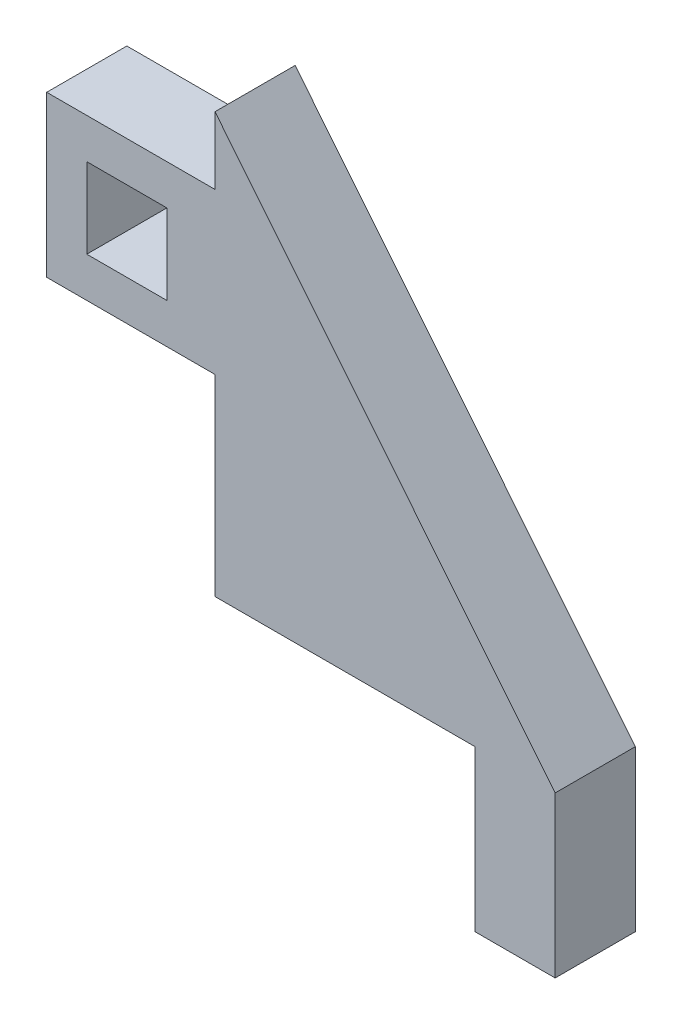
ISO-10303-21;
HEADER;
FILE_DESCRIPTION(('STEP AP214'),'2;1');
FILE_NAME('part.step','',(''),(''),'','','');
FILE_SCHEMA(('AUTOMOTIVE_DESIGN { 1 0 10303 214 1 1 1 1 }'));
ENDSEC;
DATA;
#1=APPLICATION_CONTEXT('core data for automotive mechanical design processes');
#2=APPLICATION_PROTOCOL_DEFINITION('international standard','automotive_design',2000,#1);
#3=PRODUCT_CONTEXT('',#1,'mechanical');
#4=PRODUCT('Part','Part','',(#3));
#5=PRODUCT_RELATED_PRODUCT_CATEGORY('part','',(#4));
#6=PRODUCT_DEFINITION_FORMATION('','',#4);
#7=PRODUCT_DEFINITION_CONTEXT('part definition',#1,'design');
#8=PRODUCT_DEFINITION('design','',#6,#7);
#9=PRODUCT_DEFINITION_SHAPE('','',#8);
#10=(LENGTH_UNIT() NAMED_UNIT(*) SI_UNIT(.MILLI.,.METRE.));
#11=(NAMED_UNIT(*) PLANE_ANGLE_UNIT() SI_UNIT($,.RADIAN.));
#12=(NAMED_UNIT(*) SI_UNIT($,.STERADIAN.) SOLID_ANGLE_UNIT());
#13=UNCERTAINTY_MEASURE_WITH_UNIT(LENGTH_MEASURE(1.E-05),#10,'distance_accuracy_value','');
#14=(GEOMETRIC_REPRESENTATION_CONTEXT(3) GLOBAL_UNCERTAINTY_ASSIGNED_CONTEXT((#13)) GLOBAL_UNIT_ASSIGNED_CONTEXT((#10,
#11,#12)) REPRESENTATION_CONTEXT('',''));
#15=CARTESIAN_POINT('',(0.,0.,0.));
#16=DIRECTION('',(0.,0.,1.));
#17=DIRECTION('',(1.,0.,0.));
#18=AXIS2_PLACEMENT_3D('',#15,#16,#17);
#19=CARTESIAN_POINT('',(0.,0.,5.));
#20=DIRECTION('',(1.,0.,0.));
#21=DIRECTION('',(0.,0.,-1.));
#22=AXIS2_PLACEMENT_3D('',#19,#20,#21);
#23=PLANE('',#22);
#24=DIRECTION('',(0.,0.,-1.));
#25=VECTOR('',#24,1.);
#26=CARTESIAN_POINT('',(0.,22.,0.));
#27=LINE('',#26,#25);
#28=CARTESIAN_POINT('',(0.,22.,5.));
#29=VERTEX_POINT('',#28);
#30=CARTESIAN_POINT('',(0.,22.,0.));
#31=VERTEX_POINT('',#30);
#32=EDGE_CURVE('E178',#29,#31,#27,.T.);
#33=ORIENTED_EDGE('',*,*,#32,.F.);
#34=DIRECTION('',(0.,-1.,0.));
#35=VECTOR('',#34,1.);
#36=CARTESIAN_POINT('',(0.,0.,5.));
#37=LINE('',#36,#35);
#38=CARTESIAN_POINT('',(0.,26.2,5.));
#39=VERTEX_POINT('',#38);
#40=EDGE_CURVE('E225',#39,#29,#37,.T.);
#41=ORIENTED_EDGE('',*,*,#40,.F.);
#42=DIRECTION('',(0.,0.,-1.));
#43=VECTOR('',#42,1.);
#44=CARTESIAN_POINT('',(0.,26.2,5.));
#45=LINE('',#44,#43);
#46=CARTESIAN_POINT('',(0.,26.2,0.));
#47=VERTEX_POINT('',#46);
#48=EDGE_CURVE('E42',#39,#47,#45,.T.);
#49=ORIENTED_EDGE('',*,*,#48,.T.);
#50=DIRECTION('',(0.,-1.,0.));
#51=VECTOR('',#50,1.);
#52=CARTESIAN_POINT('',(0.,0.,0.));
#53=LINE('',#52,#51);
#54=EDGE_CURVE('E253',#47,#31,#53,.T.);
#55=ORIENTED_EDGE('',*,*,#54,.T.);
#56=EDGE_LOOP('',(#33,#41,#49,#55));
#57=FACE_BOUND('',#56,.T.);
#58=ADVANCED_FACE('F33',(#57),#23,.F.);
#59=DIRECTION('',(0.,0.,1.));
#60=VECTOR('',#59,1.);
#61=CARTESIAN_POINT('',(0.,12.,0.));
#62=LINE('',#61,#60);
#63=CARTESIAN_POINT('',(0.,12.,0.));
#64=VERTEX_POINT('',#63);
#65=CARTESIAN_POINT('',(0.,12.,5.));
#66=VERTEX_POINT('',#65);
#67=EDGE_CURVE('E173',#64,#66,#62,.T.);
#68=ORIENTED_EDGE('',*,*,#67,.F.);
#69=CARTESIAN_POINT('',(0.,0.,0.));
#70=VERTEX_POINT('',#69);
#71=EDGE_CURVE('E235',#64,#70,#53,.T.);
#72=ORIENTED_EDGE('',*,*,#71,.T.);
#73=DIRECTION('',(0.,0.,-1.));
#74=VECTOR('',#73,1.);
#75=CARTESIAN_POINT('',(0.,0.,5.));
#76=LINE('',#75,#74);
#77=CARTESIAN_POINT('',(0.,0.,5.));
#78=VERTEX_POINT('',#77);
#79=EDGE_CURVE('E231',#78,#70,#76,.T.);
#80=ORIENTED_EDGE('',*,*,#79,.F.);
#81=EDGE_CURVE('E193',#66,#78,#37,.T.);
#82=ORIENTED_EDGE('',*,*,#81,.F.);
#83=EDGE_LOOP('',(#68,#72,#80,#82));
#84=FACE_BOUND('',#83,.T.);
#85=ADVANCED_FACE('F307',(#84),#23,.F.);
#86=CARTESIAN_POINT('',(21.2263986582746,0.,5.));
#87=DIRECTION('',(0.,1.,0.));
#88=DIRECTION('',(0.,0.,1.));
#89=AXIS2_PLACEMENT_3D('',#86,#87,#88);
#90=PLANE('',#89);
#91=DIRECTION('',(0.,0.,-1.));
#92=VECTOR('',#91,1.);
#93=CARTESIAN_POINT('',(16.2263986582746,0.,5.));
#94=LINE('',#93,#92);
#95=CARTESIAN_POINT('',(16.2263986582746,0.,5.));
#96=VERTEX_POINT('',#95);
#97=CARTESIAN_POINT('',(16.2263986582746,0.,0.));
#98=VERTEX_POINT('',#97);
#99=EDGE_CURVE('E205',#96,#98,#94,.T.);
#100=ORIENTED_EDGE('',*,*,#99,.F.);
#101=DIRECTION('',(1.,0.,0.));
#102=VECTOR('',#101,1.);
#103=CARTESIAN_POINT('',(21.2263986582746,0.,5.));
#104=LINE('',#103,#102);
#105=EDGE_CURVE('E251',#78,#96,#104,.T.);
#106=ORIENTED_EDGE('',*,*,#105,.F.);
#107=ORIENTED_EDGE('',*,*,#79,.T.);
#108=DIRECTION('',(1.,0.,0.));
#109=VECTOR('',#108,1.);
#110=CARTESIAN_POINT('',(21.2263986582746,0.,0.));
#111=LINE('',#110,#109);
#112=EDGE_CURVE('E247',#70,#98,#111,.T.);
#113=ORIENTED_EDGE('',*,*,#112,.T.);
#114=EDGE_LOOP('',(#100,#106,#107,#113));
#115=FACE_BOUND('',#114,.T.);
#116=ADVANCED_FACE('F35',(#115),#90,.F.);
#117=CARTESIAN_POINT('',(0.,26.2,5.));
#118=DIRECTION('',(-0.777000071877377,-0.629500506991496,0.));
#119=DIRECTION('',(0.629500506991496,-0.777000071877377,0.));
#120=AXIS2_PLACEMENT_3D('',#117,#118,#119);
#121=PLANE('',#120);
#122=DIRECTION('',(-0.629500506991496,0.777000071877377,0.));
#123=VECTOR('',#122,1.);
#124=CARTESIAN_POINT('',(0.,26.2,0.));
#125=LINE('',#124,#123);
#126=CARTESIAN_POINT('',(21.2263986582746,0.,0.));
#127=VERTEX_POINT('',#126);
#128=EDGE_CURVE('E245',#127,#47,#125,.T.);
#129=ORIENTED_EDGE('',*,*,#128,.T.);
#130=ORIENTED_EDGE('',*,*,#48,.F.);
#131=DIRECTION('',(-0.629500506991496,0.777000071877377,0.));
#132=VECTOR('',#131,1.);
#133=CARTESIAN_POINT('',(0.,26.2,5.));
#134=LINE('',#133,#132);
#135=CARTESIAN_POINT('',(21.2263986582746,0.,5.));
#136=VERTEX_POINT('',#135);
#137=EDGE_CURVE('E227',#136,#39,#134,.T.);
#138=ORIENTED_EDGE('',*,*,#137,.F.);
#139=DIRECTION('',(0.,0.,-1.));
#140=VECTOR('',#139,1.);
#141=CARTESIAN_POINT('',(21.2263986582746,0.,5.));
#142=LINE('',#141,#140);
#143=EDGE_CURVE('E11',#136,#127,#142,.T.);
#144=ORIENTED_EDGE('',*,*,#143,.T.);
#145=EDGE_LOOP('',(#129,#130,#138,#144));
#146=FACE_BOUND('',#145,.T.);
#147=ADVANCED_FACE('F309',(#146),#121,.F.);
#148=CARTESIAN_POINT('',(0.,0.,5.));
#149=DIRECTION('',(0.,0.,-1.));
#150=DIRECTION('',(-1.,0.,0.));
#151=AXIS2_PLACEMENT_3D('',#148,#149,#150);
#152=PLANE('',#151);
#153=DIRECTION('',(1.,0.,0.));
#154=VECTOR('',#153,1.);
#155=CARTESIAN_POINT('',(0.,19.5,5.));
#156=LINE('',#155,#154);
#157=CARTESIAN_POINT('',(-8.,19.5,5.));
#158=VERTEX_POINT('',#157);
#159=CARTESIAN_POINT('',(-3.,19.5,5.));
#160=VERTEX_POINT('',#159);
#161=EDGE_CURVE('E167',#158,#160,#156,.T.);
#162=ORIENTED_EDGE('',*,*,#161,.T.);
#163=DIRECTION('',(0.,-1.,0.));
#164=VECTOR('',#163,1.);
#165=CARTESIAN_POINT('',(-3.,0.,5.));
#166=LINE('',#165,#164);
#167=CARTESIAN_POINT('',(-3.,14.5,5.));
#168=VERTEX_POINT('',#167);
#169=EDGE_CURVE('E170',#160,#168,#166,.T.);
#170=ORIENTED_EDGE('',*,*,#169,.T.);
#171=DIRECTION('',(-1.,0.,0.));
#172=VECTOR('',#171,1.);
#173=CARTESIAN_POINT('',(0.,14.5,5.));
#174=LINE('',#173,#172);
#175=CARTESIAN_POINT('',(-8.,14.5,5.));
#176=VERTEX_POINT('',#175);
#177=EDGE_CURVE('E162',#168,#176,#174,.T.);
#178=ORIENTED_EDGE('',*,*,#177,.T.);
#179=DIRECTION('',(0.,1.,0.));
#180=VECTOR('',#179,1.);
#181=CARTESIAN_POINT('',(-8.,0.,5.));
#182=LINE('',#181,#180);
#183=EDGE_CURVE('E142',#176,#158,#182,.T.);
#184=ORIENTED_EDGE('',*,*,#183,.T.);
#185=EDGE_LOOP('',(#162,#170,#178,#184));
#186=FACE_BOUND('',#185,.T.);
#187=ORIENTED_EDGE('',*,*,#105,.T.);
#188=DIRECTION('',(0.,1.,0.));
#189=VECTOR('',#188,1.);
#190=CARTESIAN_POINT('',(16.2263986582746,-10.,5.));
#191=LINE('',#190,#189);
#192=CARTESIAN_POINT('',(16.2263986582746,-10.,5.));
#193=VERTEX_POINT('',#192);
#194=EDGE_CURVE('E259',#193,#96,#191,.T.);
#195=ORIENTED_EDGE('',*,*,#194,.F.);
#196=DIRECTION('',(-1.,0.,0.));
#197=VECTOR('',#196,1.);
#198=CARTESIAN_POINT('',(21.2263986582746,-10.,5.));
#199=LINE('',#198,#197);
#200=CARTESIAN_POINT('',(21.2263986582746,-10.,5.));
#201=VERTEX_POINT('',#200);
#202=EDGE_CURVE('E269',#201,#193,#199,.T.);
#203=ORIENTED_EDGE('',*,*,#202,.F.);
#204=DIRECTION('',(0.,1.,0.));
#205=VECTOR('',#204,1.);
#206=CARTESIAN_POINT('',(21.2263986582746,-10.,5.));
#207=LINE('',#206,#205);
#208=EDGE_CURVE('E249',#201,#136,#207,.T.);
#209=ORIENTED_EDGE('',*,*,#208,.T.);
#210=ORIENTED_EDGE('',*,*,#137,.T.);
#211=ORIENTED_EDGE('',*,*,#40,.T.);
#212=DIRECTION('',(1.,0.,0.));
#213=VECTOR('',#212,1.);
#214=CARTESIAN_POINT('',(-10.5,22.,5.));
#215=LINE('',#214,#213);
#216=CARTESIAN_POINT('',(-10.5,22.,5.));
#217=VERTEX_POINT('',#216);
#218=EDGE_CURVE('E200',#217,#29,#215,.T.);
#219=ORIENTED_EDGE('',*,*,#218,.F.);
#220=DIRECTION('',(0.,1.,0.));
#221=VECTOR('',#220,1.);
#222=CARTESIAN_POINT('',(-10.5,22.,5.));
#223=LINE('',#222,#221);
#224=CARTESIAN_POINT('',(-10.5,12.,5.));
#225=VERTEX_POINT('',#224);
#226=EDGE_CURVE('E180',#225,#217,#223,.T.);
#227=ORIENTED_EDGE('',*,*,#226,.F.);
#228=DIRECTION('',(1.,0.,0.));
#229=VECTOR('',#228,1.);
#230=CARTESIAN_POINT('',(-10.5,12.,5.));
#231=LINE('',#230,#229);
#232=EDGE_CURVE('E196',#225,#66,#231,.T.);
#233=ORIENTED_EDGE('',*,*,#232,.T.);
#234=ORIENTED_EDGE('',*,*,#81,.T.);
#235=EDGE_LOOP('',(#187,#195,#203,#209,#210,#211,#219,#227,#233,#234));
#236=FACE_BOUND('',#235,.T.);
#237=ADVANCED_FACE('F223',(#186,#236),#152,.F.);
#238=CARTESIAN_POINT('',(0.,0.,0.));
#239=DIRECTION('',(0.,0.,-1.));
#240=DIRECTION('',(-1.,0.,0.));
#241=AXIS2_PLACEMENT_3D('',#238,#239,#240);
#242=PLANE('',#241);
#243=DIRECTION('',(0.,-1.,0.));
#244=VECTOR('',#243,1.);
#245=CARTESIAN_POINT('',(-3.,19.5,0.));
#246=LINE('',#245,#244);
#247=CARTESIAN_POINT('',(-3.,19.5,0.));
#248=VERTEX_POINT('',#247);
#249=CARTESIAN_POINT('',(-3.,14.5,0.));
#250=VERTEX_POINT('',#249);
#251=EDGE_CURVE('E58',#248,#250,#246,.T.);
#252=ORIENTED_EDGE('',*,*,#251,.F.);
#253=DIRECTION('',(1.,0.,0.));
#254=VECTOR('',#253,1.);
#255=CARTESIAN_POINT('',(-3.,19.5,0.));
#256=LINE('',#255,#254);
#257=CARTESIAN_POINT('',(-8.,19.5,0.));
#258=VERTEX_POINT('',#257);
#259=EDGE_CURVE('E155',#258,#248,#256,.T.);
#260=ORIENTED_EDGE('',*,*,#259,.F.);
#261=DIRECTION('',(0.,1.,0.));
#262=VECTOR('',#261,1.);
#263=CARTESIAN_POINT('',(-8.,19.5,0.));
#264=LINE('',#263,#262);
#265=CARTESIAN_POINT('',(-8.,14.5,0.));
#266=VERTEX_POINT('',#265);
#267=EDGE_CURVE('E139',#266,#258,#264,.T.);
#268=ORIENTED_EDGE('',*,*,#267,.F.);
#269=DIRECTION('',(-1.,0.,0.));
#270=VECTOR('',#269,1.);
#271=CARTESIAN_POINT('',(-3.,14.5,0.));
#272=LINE('',#271,#270);
#273=EDGE_CURVE('E148',#250,#266,#272,.T.);
#274=ORIENTED_EDGE('',*,*,#273,.F.);
#275=EDGE_LOOP('',(#252,#260,#268,#274));
#276=FACE_BOUND('',#275,.T.);
#277=ORIENTED_EDGE('',*,*,#112,.F.);
#278=ORIENTED_EDGE('',*,*,#71,.F.);
#279=DIRECTION('',(1.,0.,0.));
#280=VECTOR('',#279,1.);
#281=CARTESIAN_POINT('',(-10.5,12.,0.));
#282=LINE('',#281,#280);
#283=CARTESIAN_POINT('',(-10.5,12.,0.));
#284=VERTEX_POINT('',#283);
#285=EDGE_CURVE('E199',#284,#64,#282,.T.);
#286=ORIENTED_EDGE('',*,*,#285,.F.);
#287=DIRECTION('',(0.,-1.,0.));
#288=VECTOR('',#287,1.);
#289=CARTESIAN_POINT('',(-10.5,12.,0.));
#290=LINE('',#289,#288);
#291=CARTESIAN_POINT('',(-10.5,22.,0.));
#292=VERTEX_POINT('',#291);
#293=EDGE_CURVE('E174',#292,#284,#290,.T.);
#294=ORIENTED_EDGE('',*,*,#293,.F.);
#295=DIRECTION('',(1.,0.,0.));
#296=VECTOR('',#295,1.);
#297=CARTESIAN_POINT('',(-10.5,22.,0.));
#298=LINE('',#297,#296);
#299=EDGE_CURVE('E184',#292,#31,#298,.T.);
#300=ORIENTED_EDGE('',*,*,#299,.T.);
#301=ORIENTED_EDGE('',*,*,#54,.F.);
#302=ORIENTED_EDGE('',*,*,#128,.F.);
#303=DIRECTION('',(0.,1.,0.));
#304=VECTOR('',#303,1.);
#305=CARTESIAN_POINT('',(21.2263986582746,-10.,0.));
#306=LINE('',#305,#304);
#307=CARTESIAN_POINT('',(21.2263986582746,-10.,0.));
#308=VERTEX_POINT('',#307);
#309=EDGE_CURVE('E260',#308,#127,#306,.T.);
#310=ORIENTED_EDGE('',*,*,#309,.F.);
#311=DIRECTION('',(1.,0.,0.));
#312=VECTOR('',#311,1.);
#313=CARTESIAN_POINT('',(21.2263986582746,-10.,0.));
#314=LINE('',#313,#312);
#315=CARTESIAN_POINT('',(16.2263986582746,-10.,0.));
#316=VERTEX_POINT('',#315);
#317=EDGE_CURVE('E263',#316,#308,#314,.T.);
#318=ORIENTED_EDGE('',*,*,#317,.F.);
#319=DIRECTION('',(0.,1.,0.));
#320=VECTOR('',#319,1.);
#321=CARTESIAN_POINT('',(16.2263986582746,-10.,0.));
#322=LINE('',#321,#320);
#323=EDGE_CURVE('E262',#316,#98,#322,.T.);
#324=ORIENTED_EDGE('',*,*,#323,.T.);
#325=EDGE_LOOP('',(#277,#278,#286,#294,#300,#301,#302,#310,#318,#324));
#326=FACE_BOUND('',#325,.T.);
#327=ADVANCED_FACE('F152',(#276,#326),#242,.T.);
#328=CARTESIAN_POINT('',(21.2263986582746,-10.,5.));
#329=DIRECTION('',(-1.,0.,0.));
#330=DIRECTION('',(0.,0.,1.));
#331=AXIS2_PLACEMENT_3D('',#328,#329,#330);
#332=PLANE('',#331);
#333=ORIENTED_EDGE('',*,*,#143,.F.);
#334=ORIENTED_EDGE('',*,*,#208,.F.);
#335=DIRECTION('',(0.,0.,1.));
#336=VECTOR('',#335,1.);
#337=CARTESIAN_POINT('',(21.2263986582746,-10.,5.));
#338=LINE('',#337,#336);
#339=EDGE_CURVE('E270',#308,#201,#338,.T.);
#340=ORIENTED_EDGE('',*,*,#339,.F.);
#341=ORIENTED_EDGE('',*,*,#309,.T.);
#342=EDGE_LOOP('',(#333,#334,#340,#341));
#343=FACE_BOUND('',#342,.T.);
#344=ADVANCED_FACE('F321',(#343),#332,.F.);
#345=CARTESIAN_POINT('',(16.2263986582746,-10.,5.));
#346=DIRECTION('',(1.,0.,0.));
#347=DIRECTION('',(0.,0.,-1.));
#348=AXIS2_PLACEMENT_3D('',#345,#346,#347);
#349=PLANE('',#348);
#350=ORIENTED_EDGE('',*,*,#99,.T.);
#351=ORIENTED_EDGE('',*,*,#323,.F.);
#352=DIRECTION('',(0.,0.,-1.));
#353=VECTOR('',#352,1.);
#354=CARTESIAN_POINT('',(16.2263986582746,-10.,5.));
#355=LINE('',#354,#353);
#356=EDGE_CURVE('E267',#193,#316,#355,.T.);
#357=ORIENTED_EDGE('',*,*,#356,.F.);
#358=ORIENTED_EDGE('',*,*,#194,.T.);
#359=EDGE_LOOP('',(#350,#351,#357,#358));
#360=FACE_BOUND('',#359,.T.);
#361=ADVANCED_FACE('F280',(#360),#349,.F.);
#362=CARTESIAN_POINT('',(0.,-10.,0.));
#363=DIRECTION('',(0.,1.,0.));
#364=DIRECTION('',(0.,0.,1.));
#365=AXIS2_PLACEMENT_3D('',#362,#363,#364);
#366=PLANE('',#365);
#367=ORIENTED_EDGE('',*,*,#339,.T.);
#368=ORIENTED_EDGE('',*,*,#202,.T.);
#369=ORIENTED_EDGE('',*,*,#356,.T.);
#370=ORIENTED_EDGE('',*,*,#317,.T.);
#371=EDGE_LOOP('',(#367,#368,#369,#370));
#372=FACE_BOUND('',#371,.T.);
#373=ADVANCED_FACE('F330',(#372),#366,.F.);
#374=CARTESIAN_POINT('',(-10.5,12.,0.));
#375=DIRECTION('',(0.,1.,0.));
#376=DIRECTION('',(0.,0.,1.));
#377=AXIS2_PLACEMENT_3D('',#374,#375,#376);
#378=PLANE('',#377);
#379=ORIENTED_EDGE('',*,*,#67,.T.);
#380=ORIENTED_EDGE('',*,*,#232,.F.);
#381=DIRECTION('',(0.,0.,1.));
#382=VECTOR('',#381,1.);
#383=CARTESIAN_POINT('',(-10.5,12.,0.));
#384=LINE('',#383,#382);
#385=EDGE_CURVE('E177',#284,#225,#384,.T.);
#386=ORIENTED_EDGE('',*,*,#385,.F.);
#387=ORIENTED_EDGE('',*,*,#285,.T.);
#388=EDGE_LOOP('',(#379,#380,#386,#387));
#389=FACE_BOUND('',#388,.T.);
#390=ADVANCED_FACE('F304',(#389),#378,.F.);
#391=CARTESIAN_POINT('',(-10.5,22.,0.));
#392=DIRECTION('',(0.,-1.,0.));
#393=DIRECTION('',(0.,0.,-1.));
#394=AXIS2_PLACEMENT_3D('',#391,#392,#393);
#395=PLANE('',#394);
#396=ORIENTED_EDGE('',*,*,#32,.T.);
#397=ORIENTED_EDGE('',*,*,#299,.F.);
#398=DIRECTION('',(0.,0.,-1.));
#399=VECTOR('',#398,1.);
#400=CARTESIAN_POINT('',(-10.5,22.,0.));
#401=LINE('',#400,#399);
#402=EDGE_CURVE('E182',#217,#292,#401,.T.);
#403=ORIENTED_EDGE('',*,*,#402,.F.);
#404=ORIENTED_EDGE('',*,*,#218,.T.);
#405=EDGE_LOOP('',(#396,#397,#403,#404));
#406=FACE_BOUND('',#405,.T.);
#407=ADVANCED_FACE('F217',(#406),#395,.F.);
#408=CARTESIAN_POINT('',(-10.5,0.,0.));
#409=DIRECTION('',(1.,0.,0.));
#410=DIRECTION('',(0.,0.,-1.));
#411=AXIS2_PLACEMENT_3D('',#408,#409,#410);
#412=PLANE('',#411);
#413=ORIENTED_EDGE('',*,*,#293,.T.);
#414=ORIENTED_EDGE('',*,*,#385,.T.);
#415=ORIENTED_EDGE('',*,*,#226,.T.);
#416=ORIENTED_EDGE('',*,*,#402,.T.);
#417=EDGE_LOOP('',(#413,#414,#415,#416));
#418=FACE_BOUND('',#417,.T.);
#419=ADVANCED_FACE('F301',(#418),#412,.F.);
#420=CARTESIAN_POINT('',(-3.,19.5,10.));
#421=DIRECTION('',(1.,0.,0.));
#422=DIRECTION('',(0.,1.,0.));
#423=AXIS2_PLACEMENT_3D('',#420,#421,#422);
#424=PLANE('',#423);
#425=DIRECTION('',(0.,0.,-1.));
#426=VECTOR('',#425,1.);
#427=CARTESIAN_POINT('',(-3.,19.5,10.));
#428=LINE('',#427,#426);
#429=EDGE_CURVE('E160',#160,#248,#428,.T.);
#430=ORIENTED_EDGE('',*,*,#429,.T.);
#431=ORIENTED_EDGE('',*,*,#251,.T.);
#432=DIRECTION('',(0.,0.,-1.));
#433=VECTOR('',#432,1.);
#434=CARTESIAN_POINT('',(-3.,14.5,10.));
#435=LINE('',#434,#433);
#436=EDGE_CURVE('E145',#168,#250,#435,.T.);
#437=ORIENTED_EDGE('',*,*,#436,.F.);
#438=ORIENTED_EDGE('',*,*,#169,.F.);
#439=EDGE_LOOP('',(#430,#431,#437,#438));
#440=FACE_BOUND('',#439,.T.);
#441=ADVANCED_FACE('F339',(#440),#424,.F.);
#442=CARTESIAN_POINT('',(-3.,19.5,10.));
#443=DIRECTION('',(0.,1.,0.));
#444=DIRECTION('',(0.,0.,1.));
#445=AXIS2_PLACEMENT_3D('',#442,#443,#444);
#446=PLANE('',#445);
#447=DIRECTION('',(0.,0.,-1.));
#448=VECTOR('',#447,1.);
#449=CARTESIAN_POINT('',(-8.,19.5,10.));
#450=LINE('',#449,#448);
#451=EDGE_CURVE('E144',#158,#258,#450,.T.);
#452=ORIENTED_EDGE('',*,*,#451,.T.);
#453=ORIENTED_EDGE('',*,*,#259,.T.);
#454=ORIENTED_EDGE('',*,*,#429,.F.);
#455=ORIENTED_EDGE('',*,*,#161,.F.);
#456=EDGE_LOOP('',(#452,#453,#454,#455));
#457=FACE_BOUND('',#456,.T.);
#458=ADVANCED_FACE('F342',(#457),#446,.F.);
#459=CARTESIAN_POINT('',(-8.,19.5,10.));
#460=DIRECTION('',(-1.,0.,0.));
#461=DIRECTION('',(0.,0.,1.));
#462=AXIS2_PLACEMENT_3D('',#459,#460,#461);
#463=PLANE('',#462);
#464=DIRECTION('',(0.,0.,-1.));
#465=VECTOR('',#464,1.);
#466=CARTESIAN_POINT('',(-8.,14.5,10.));
#467=LINE('',#466,#465);
#468=EDGE_CURVE('E50',#176,#266,#467,.T.);
#469=ORIENTED_EDGE('',*,*,#468,.T.);
#470=ORIENTED_EDGE('',*,*,#267,.T.);
#471=ORIENTED_EDGE('',*,*,#451,.F.);
#472=ORIENTED_EDGE('',*,*,#183,.F.);
#473=EDGE_LOOP('',(#469,#470,#471,#472));
#474=FACE_BOUND('',#473,.T.);
#475=ADVANCED_FACE('F136',(#474),#463,.F.);
#476=CARTESIAN_POINT('',(-3.,14.5,10.));
#477=DIRECTION('',(0.,-1.,0.));
#478=DIRECTION('',(0.,0.,-1.));
#479=AXIS2_PLACEMENT_3D('',#476,#477,#478);
#480=PLANE('',#479);
#481=ORIENTED_EDGE('',*,*,#436,.T.);
#482=ORIENTED_EDGE('',*,*,#273,.T.);
#483=ORIENTED_EDGE('',*,*,#468,.F.);
#484=ORIENTED_EDGE('',*,*,#177,.F.);
#485=EDGE_LOOP('',(#481,#482,#483,#484));
#486=FACE_BOUND('',#485,.T.);
#487=ADVANCED_FACE('F149',(#486),#480,.F.);
#488=CLOSED_SHELL('',(#58,#85,#116,#147,#237,#327,#344,#361,#373,#390,#407,#419,#441,#458,#475,#487));
#489=MANIFOLD_SOLID_BREP('B2',#488);
#490=ADVANCED_BREP_SHAPE_REPRESENTATION('',(#18,#489),#14);
#491=SHAPE_DEFINITION_REPRESENTATION(#9,#490);
ENDSEC;
END-ISO-10303-21;
